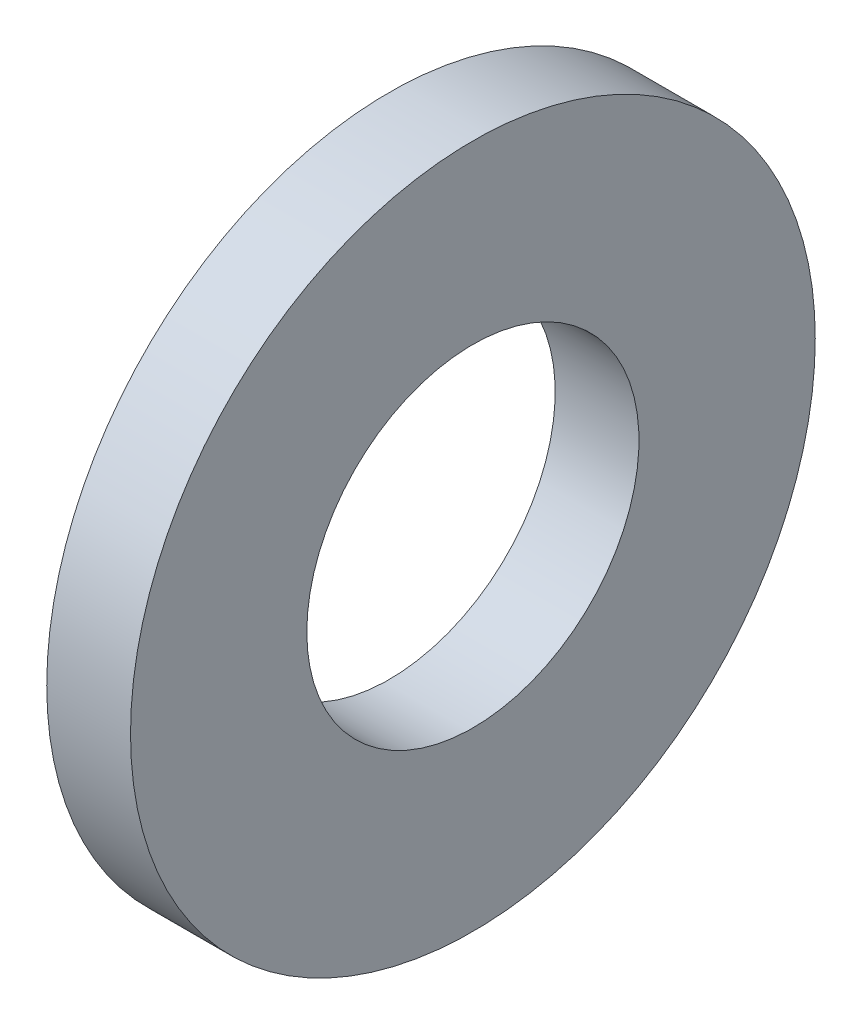
ISO-10303-21;
HEADER;
FILE_DESCRIPTION(('STEP AP214'),'2;1');
FILE_NAME('part.step','',(''),(''),'','','');
FILE_SCHEMA(('AUTOMOTIVE_DESIGN { 1 0 10303 214 1 1 1 1 }'));
ENDSEC;
DATA;
#1=APPLICATION_CONTEXT('core data for automotive mechanical design processes');
#2=APPLICATION_PROTOCOL_DEFINITION('international standard','automotive_design',2000,#1);
#3=PRODUCT_CONTEXT('',#1,'mechanical');
#4=PRODUCT('Part','Part','',(#3));
#5=PRODUCT_RELATED_PRODUCT_CATEGORY('part','',(#4));
#6=PRODUCT_DEFINITION_FORMATION('','',#4);
#7=PRODUCT_DEFINITION_CONTEXT('part definition',#1,'design');
#8=PRODUCT_DEFINITION('design','',#6,#7);
#9=PRODUCT_DEFINITION_SHAPE('','',#8);
#10=(LENGTH_UNIT() NAMED_UNIT(*) SI_UNIT(.MILLI.,.METRE.));
#11=(NAMED_UNIT(*) PLANE_ANGLE_UNIT() SI_UNIT($,.RADIAN.));
#12=(NAMED_UNIT(*) SI_UNIT($,.STERADIAN.) SOLID_ANGLE_UNIT());
#13=UNCERTAINTY_MEASURE_WITH_UNIT(LENGTH_MEASURE(1.E-05),#10,'distance_accuracy_value','');
#14=(GEOMETRIC_REPRESENTATION_CONTEXT(3) GLOBAL_UNCERTAINTY_ASSIGNED_CONTEXT((#13)) GLOBAL_UNIT_ASSIGNED_CONTEXT((#10,
#11,#12)) REPRESENTATION_CONTEXT('',''));
#15=CARTESIAN_POINT('',(0.,0.,0.));
#16=DIRECTION('',(0.,0.,1.));
#17=DIRECTION('',(1.,0.,0.));
#18=AXIS2_PLACEMENT_3D('',#15,#16,#17);
#19=CARTESIAN_POINT('',(-34.9249999999999,0.,0.));
#20=DIRECTION('',(-1.,0.,0.));
#21=DIRECTION('',(0.,0.,1.));
#22=AXIS2_PLACEMENT_3D('',#19,#20,#21);
#23=CYLINDRICAL_SURFACE('',#22,4.56);
#24=CARTESIAN_POINT('',(0.,0.,0.));
#25=DIRECTION('',(-1.,0.,0.));
#26=DIRECTION('',(0.,0.,1.));
#27=AXIS2_PLACEMENT_3D('',#24,#25,#26);
#28=CIRCLE('',#27,4.56);
#29=CARTESIAN_POINT('',(0.,0.,4.56));
#30=VERTEX_POINT('',#29);
#31=EDGE_CURVE('E10',#30,#30,#28,.T.);
#32=ORIENTED_EDGE('',*,*,#31,.F.);
#33=EDGE_LOOP('',(#32));
#34=FACE_BOUND('',#33,.T.);
#35=CARTESIAN_POINT('',(-2.3,0.,0.));
#36=DIRECTION('',(-1.,0.,0.));
#37=DIRECTION('',(0.,0.,1.));
#38=AXIS2_PLACEMENT_3D('',#35,#36,#37);
#39=CIRCLE('',#38,4.56);
#40=CARTESIAN_POINT('',(-2.3,0.,4.56));
#41=VERTEX_POINT('',#40);
#42=EDGE_CURVE('E46',#41,#41,#39,.T.);
#43=ORIENTED_EDGE('',*,*,#42,.T.);
#44=EDGE_LOOP('',(#43));
#45=FACE_BOUND('',#44,.T.);
#46=ADVANCED_FACE('F32',(#34,#45),#23,.F.);
#47=CARTESIAN_POINT('',(0.,4.56,0.));
#48=DIRECTION('',(-1.,0.,0.));
#49=DIRECTION('',(0.,0.,1.));
#50=AXIS2_PLACEMENT_3D('',#47,#48,#49);
#51=PLANE('',#50);
#52=CARTESIAN_POINT('',(0.,0.,0.));
#53=DIRECTION('',(-1.,0.,0.));
#54=DIRECTION('',(0.,0.,1.));
#55=AXIS2_PLACEMENT_3D('',#52,#53,#54);
#56=CIRCLE('',#55,9.4);
#57=CARTESIAN_POINT('',(0.,0.,9.4));
#58=VERTEX_POINT('',#57);
#59=EDGE_CURVE('E38',#58,#58,#56,.T.);
#60=ORIENTED_EDGE('',*,*,#59,.F.);
#61=EDGE_LOOP('',(#60));
#62=FACE_BOUND('',#61,.T.);
#63=ORIENTED_EDGE('',*,*,#31,.T.);
#64=EDGE_LOOP('',(#63));
#65=FACE_BOUND('',#64,.T.);
#66=ADVANCED_FACE('F61',(#62,#65),#51,.F.);
#67=CARTESIAN_POINT('',(-34.9249999999999,0.,0.));
#68=DIRECTION('',(-1.,0.,0.));
#69=DIRECTION('',(0.,0.,1.));
#70=AXIS2_PLACEMENT_3D('',#67,#68,#69);
#71=CYLINDRICAL_SURFACE('',#70,9.4);
#72=CARTESIAN_POINT('',(-2.3,0.,0.));
#73=DIRECTION('',(-1.,0.,0.));
#74=DIRECTION('',(0.,0.,1.));
#75=AXIS2_PLACEMENT_3D('',#72,#73,#74);
#76=CIRCLE('',#75,9.4);
#77=CARTESIAN_POINT('',(-2.3,0.,9.4));
#78=VERTEX_POINT('',#77);
#79=EDGE_CURVE('E42',#78,#78,#76,.T.);
#80=ORIENTED_EDGE('',*,*,#79,.F.);
#81=EDGE_LOOP('',(#80));
#82=FACE_BOUND('',#81,.T.);
#83=ORIENTED_EDGE('',*,*,#59,.T.);
#84=EDGE_LOOP('',(#83));
#85=FACE_BOUND('',#84,.T.);
#86=ADVANCED_FACE('F56',(#82,#85),#71,.T.);
#87=CARTESIAN_POINT('',(-2.3,9.4,0.));
#88=DIRECTION('',(1.,0.,0.));
#89=DIRECTION('',(0.,0.,-1.));
#90=AXIS2_PLACEMENT_3D('',#87,#88,#89);
#91=PLANE('',#90);
#92=ORIENTED_EDGE('',*,*,#42,.F.);
#93=EDGE_LOOP('',(#92));
#94=FACE_BOUND('',#93,.T.);
#95=ORIENTED_EDGE('',*,*,#79,.T.);
#96=EDGE_LOOP('',(#95));
#97=FACE_BOUND('',#96,.T.);
#98=ADVANCED_FACE('F53',(#94,#97),#91,.F.);
#99=CLOSED_SHELL('',(#46,#66,#86,#98));
#100=MANIFOLD_SOLID_BREP('B2',#99);
#101=ADVANCED_BREP_SHAPE_REPRESENTATION('',(#18,#100),#14);
#102=SHAPE_DEFINITION_REPRESENTATION(#9,#101);
ENDSEC;
END-ISO-10303-21;
